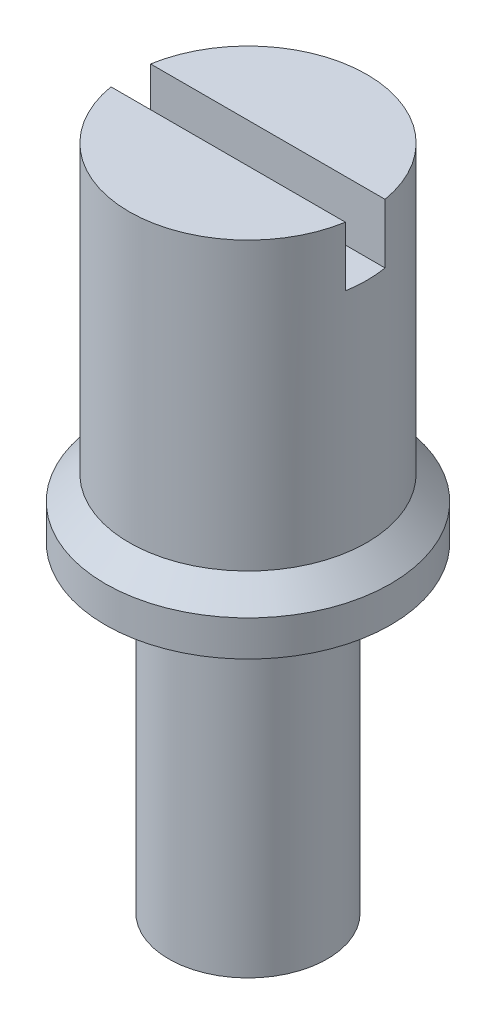
ISO-10303-21;
HEADER;
FILE_DESCRIPTION(('STEP AP214'),'2;1');
FILE_NAME('part.step','',(''),(''),'','','');
FILE_SCHEMA(('AUTOMOTIVE_DESIGN { 1 0 10303 214 1 1 1 1 }'));
ENDSEC;
DATA;
#1=APPLICATION_CONTEXT('core data for automotive mechanical design processes');
#2=APPLICATION_PROTOCOL_DEFINITION('international standard','automotive_design',2000,#1);
#3=PRODUCT_CONTEXT('',#1,'mechanical');
#4=PRODUCT('Part','Part','',(#3));
#5=PRODUCT_RELATED_PRODUCT_CATEGORY('part','',(#4));
#6=PRODUCT_DEFINITION_FORMATION('','',#4);
#7=PRODUCT_DEFINITION_CONTEXT('part definition',#1,'design');
#8=PRODUCT_DEFINITION('design','',#6,#7);
#9=PRODUCT_DEFINITION_SHAPE('','',#8);
#10=(LENGTH_UNIT() NAMED_UNIT(*) SI_UNIT(.MILLI.,.METRE.));
#11=(NAMED_UNIT(*) PLANE_ANGLE_UNIT() SI_UNIT($,.RADIAN.));
#12=(NAMED_UNIT(*) SI_UNIT($,.STERADIAN.) SOLID_ANGLE_UNIT());
#13=UNCERTAINTY_MEASURE_WITH_UNIT(LENGTH_MEASURE(1.E-05),#10,'distance_accuracy_value','');
#14=(GEOMETRIC_REPRESENTATION_CONTEXT(3) GLOBAL_UNCERTAINTY_ASSIGNED_CONTEXT((#13)) GLOBAL_UNIT_ASSIGNED_CONTEXT((#10,
#11,#12)) REPRESENTATION_CONTEXT('',''));
#15=CARTESIAN_POINT('',(0.,0.,0.));
#16=DIRECTION('',(0.,0.,1.));
#17=DIRECTION('',(1.,0.,0.));
#18=AXIS2_PLACEMENT_3D('',#15,#16,#17);
#19=CARTESIAN_POINT('',(0.,43.3233707150231,0.));
#20=DIRECTION('',(0.,1.,0.));
#21=DIRECTION('',(-1.,0.,0.));
#22=AXIS2_PLACEMENT_3D('',#19,#20,#21);
#23=CYLINDRICAL_SURFACE('',#22,3.);
#24=CARTESIAN_POINT('',(0.,1.5,0.));
#25=DIRECTION('',(0.,1.,0.));
#26=DIRECTION('',(-1.,0.,0.));
#27=AXIS2_PLACEMENT_3D('',#24,#25,#26);
#28=CIRCLE('',#27,3.);
#29=CARTESIAN_POINT('',(-3.,1.5,0.));
#30=VERTEX_POINT('',#29);
#31=EDGE_CURVE('E89',#30,#30,#28,.T.);
#32=ORIENTED_EDGE('',*,*,#31,.T.);
#33=EDGE_LOOP('',(#32));
#34=FACE_BOUND('',#33,.T.);
#35=DIRECTION('',(0.,1.,0.));
#36=VECTOR('',#35,1.);
#37=CARTESIAN_POINT('',(-2.95803989154982,43.3233707150231,-0.5));
#38=LINE('',#37,#36);
#39=CARTESIAN_POINT('',(-2.95803989154981,8.73125,-0.5));
#40=VERTEX_POINT('',#39);
#41=CARTESIAN_POINT('',(-2.95803989154981,7.23125,-0.5));
#42=VERTEX_POINT('',#41);
#43=EDGE_CURVE('E86',#40,#42,#38,.F.);
#44=ORIENTED_EDGE('',*,*,#43,.F.);
#45=CARTESIAN_POINT('',(0.,8.73125,0.));
#46=DIRECTION('',(0.,1.,0.));
#47=DIRECTION('',(-1.,0.,0.));
#48=AXIS2_PLACEMENT_3D('',#45,#46,#47);
#49=CIRCLE('',#48,3.00000000000001);
#50=CARTESIAN_POINT('',(2.95803989154981,8.73125,-0.5));
#51=VERTEX_POINT('',#50);
#52=EDGE_CURVE('E90',#51,#40,#49,.T.);
#53=ORIENTED_EDGE('',*,*,#52,.F.);
#54=DIRECTION('',(0.,1.,0.));
#55=VECTOR('',#54,1.);
#56=CARTESIAN_POINT('',(2.9580398915498,43.3233707150231,-0.5));
#57=LINE('',#56,#55);
#58=CARTESIAN_POINT('',(2.95803989154981,7.23125,-0.5));
#59=VERTEX_POINT('',#58);
#60=EDGE_CURVE('E96',#59,#51,#57,.T.);
#61=ORIENTED_EDGE('',*,*,#60,.F.);
#62=CARTESIAN_POINT('',(0.,7.23125,0.));
#63=DIRECTION('',(0.,-1.,0.));
#64=DIRECTION('',(1.,0.,0.));
#65=AXIS2_PLACEMENT_3D('',#62,#63,#64);
#66=CIRCLE('',#65,3.);
#67=CARTESIAN_POINT('',(2.95803989154981,7.23125,0.5));
#68=VERTEX_POINT('',#67);
#69=EDGE_CURVE('E36',#59,#68,#66,.T.);
#70=ORIENTED_EDGE('',*,*,#69,.T.);
#71=DIRECTION('',(0.,1.,0.));
#72=VECTOR('',#71,1.);
#73=CARTESIAN_POINT('',(2.9580398915498,43.3233707150231,0.5));
#74=LINE('',#73,#72);
#75=CARTESIAN_POINT('',(2.95803989154981,8.73125,0.5));
#76=VERTEX_POINT('',#75);
#77=EDGE_CURVE('E75',#68,#76,#74,.T.);
#78=ORIENTED_EDGE('',*,*,#77,.T.);
#79=CARTESIAN_POINT('',(-2.95803989154981,8.73125,0.5));
#80=VERTEX_POINT('',#79);
#81=EDGE_CURVE('E84',#80,#76,#49,.T.);
#82=ORIENTED_EDGE('',*,*,#81,.F.);
#83=DIRECTION('',(0.,1.,0.));
#84=VECTOR('',#83,1.);
#85=CARTESIAN_POINT('',(-2.95803989154982,43.3233707150231,0.5));
#86=LINE('',#85,#84);
#87=CARTESIAN_POINT('',(-2.95803989154981,7.23125,0.5));
#88=VERTEX_POINT('',#87);
#89=EDGE_CURVE('E47',#80,#88,#86,.F.);
#90=ORIENTED_EDGE('',*,*,#89,.T.);
#91=EDGE_CURVE('E11',#88,#42,#66,.T.);
#92=ORIENTED_EDGE('',*,*,#91,.T.);
#93=EDGE_LOOP('',(#44,#53,#61,#70,#78,#82,#90,#92));
#94=FACE_BOUND('',#93,.T.);
#95=ADVANCED_FACE('F32',(#34,#94),#23,.T.);
#96=CARTESIAN_POINT('',(3.00000000000001,8.73125,0.));
#97=DIRECTION('',(0.,-1.,0.));
#98=DIRECTION('',(1.,0.,0.));
#99=AXIS2_PLACEMENT_3D('',#96,#97,#98);
#100=PLANE('',#99);
#101=DIRECTION('',(-1.,0.,0.));
#102=VECTOR('',#101,1.);
#103=CARTESIAN_POINT('',(3.00000000000001,8.73125,-0.5));
#104=LINE('',#103,#102);
#105=EDGE_CURVE('E79',#51,#40,#104,.T.);
#106=ORIENTED_EDGE('',*,*,#105,.F.);
#107=ORIENTED_EDGE('',*,*,#52,.T.);
#108=EDGE_LOOP('',(#106,#107));
#109=FACE_BOUND('',#108,.T.);
#110=ADVANCED_FACE('F114',(#109),#100,.F.);
#111=CARTESIAN_POINT('',(0.,-8.1,0.));
#112=DIRECTION('',(0.,1.,0.));
#113=DIRECTION('',(-1.,0.,0.));
#114=AXIS2_PLACEMENT_3D('',#111,#112,#113);
#115=PLANE('',#114);
#116=CARTESIAN_POINT('',(0.,-8.1,0.));
#117=DIRECTION('',(0.,1.,0.));
#118=DIRECTION('',(-1.,0.,0.));
#119=AXIS2_PLACEMENT_3D('',#116,#117,#118);
#120=CIRCLE('',#119,2.);
#121=CARTESIAN_POINT('',(-2.,-8.1,0.));
#122=VERTEX_POINT('',#121);
#123=EDGE_CURVE('E80',#122,#122,#120,.T.);
#124=ORIENTED_EDGE('',*,*,#123,.F.);
#125=EDGE_LOOP('',(#124));
#126=FACE_BOUND('',#125,.T.);
#127=ADVANCED_FACE('F34',(#126),#115,.F.);
#128=CARTESIAN_POINT('',(0.,43.3233707150231,0.));
#129=DIRECTION('',(0.,1.,0.));
#130=DIRECTION('',(-1.,0.,0.));
#131=AXIS2_PLACEMENT_3D('',#128,#129,#130);
#132=CYLINDRICAL_SURFACE('',#131,2.);
#133=CARTESIAN_POINT('',(0.,0.,0.));
#134=DIRECTION('',(0.,1.,0.));
#135=DIRECTION('',(-1.,0.,0.));
#136=AXIS2_PLACEMENT_3D('',#133,#134,#135);
#137=CIRCLE('',#136,2.00000000000001);
#138=CARTESIAN_POINT('',(-2.,0.,0.));
#139=VERTEX_POINT('',#138);
#140=EDGE_CURVE('E105',#139,#139,#137,.T.);
#141=ORIENTED_EDGE('',*,*,#140,.F.);
#142=EDGE_LOOP('',(#141));
#143=FACE_BOUND('',#142,.T.);
#144=ORIENTED_EDGE('',*,*,#123,.T.);
#145=EDGE_LOOP('',(#144));
#146=FACE_BOUND('',#145,.T.);
#147=ADVANCED_FACE('F121',(#143,#146),#132,.T.);
#148=CARTESIAN_POINT('',(2.00000000000001,0.,0.));
#149=DIRECTION('',(0.,1.,0.));
#150=DIRECTION('',(-1.,0.,0.));
#151=AXIS2_PLACEMENT_3D('',#148,#149,#150);
#152=PLANE('',#151);
#153=CARTESIAN_POINT('',(0.,0.,0.));
#154=DIRECTION('',(0.,1.,0.));
#155=DIRECTION('',(-1.,0.,0.));
#156=AXIS2_PLACEMENT_3D('',#153,#154,#155);
#157=CIRCLE('',#156,3.6);
#158=CARTESIAN_POINT('',(-3.6,0.,0.));
#159=VERTEX_POINT('',#158);
#160=EDGE_CURVE('E102',#159,#159,#157,.T.);
#161=ORIENTED_EDGE('',*,*,#160,.F.);
#162=EDGE_LOOP('',(#161));
#163=FACE_BOUND('',#162,.T.);
#164=ORIENTED_EDGE('',*,*,#140,.T.);
#165=EDGE_LOOP('',(#164));
#166=FACE_BOUND('',#165,.T.);
#167=ADVANCED_FACE('F140',(#163,#166),#152,.F.);
#168=CARTESIAN_POINT('',(0.,43.3233707150231,0.));
#169=DIRECTION('',(0.,1.,0.));
#170=DIRECTION('',(-1.,0.,0.));
#171=AXIS2_PLACEMENT_3D('',#168,#169,#170);
#172=CYLINDRICAL_SURFACE('',#171,3.6);
#173=CARTESIAN_POINT('',(0.,0.899999999999998,0.));
#174=DIRECTION('',(0.,1.,0.));
#175=DIRECTION('',(-1.,0.,0.));
#176=AXIS2_PLACEMENT_3D('',#173,#174,#175);
#177=CIRCLE('',#176,3.6);
#178=CARTESIAN_POINT('',(-3.6,0.899999999999997,0.));
#179=VERTEX_POINT('',#178);
#180=EDGE_CURVE('E93',#179,#179,#177,.T.);
#181=ORIENTED_EDGE('',*,*,#180,.F.);
#182=EDGE_LOOP('',(#181));
#183=FACE_BOUND('',#182,.T.);
#184=ORIENTED_EDGE('',*,*,#160,.T.);
#185=EDGE_LOOP('',(#184));
#186=FACE_BOUND('',#185,.T.);
#187=ADVANCED_FACE('F134',(#183,#186),#172,.T.);
#188=CARTESIAN_POINT('',(0.,0.899999999999998,0.));
#189=DIRECTION('',(0.,-1.,0.));
#190=DIRECTION('',(1.,0.,0.));
#191=AXIS2_PLACEMENT_3D('',#188,#189,#190);
#192=CONICAL_SURFACE('',#191,3.6,0.785398163397445);
#193=ORIENTED_EDGE('',*,*,#31,.F.);
#194=EDGE_LOOP('',(#193));
#195=FACE_BOUND('',#194,.T.);
#196=ORIENTED_EDGE('',*,*,#180,.T.);
#197=EDGE_LOOP('',(#196));
#198=FACE_BOUND('',#197,.T.);
#199=ADVANCED_FACE('F128',(#195,#198),#192,.T.);
#200=ORIENTED_EDGE('',*,*,#81,.T.);
#201=DIRECTION('',(-1.,0.,0.));
#202=VECTOR('',#201,1.);
#203=CARTESIAN_POINT('',(3.00000000000001,8.73125,0.5));
#204=LINE('',#203,#202);
#205=EDGE_CURVE('E72',#76,#80,#204,.T.);
#206=ORIENTED_EDGE('',*,*,#205,.T.);
#207=EDGE_LOOP('',(#200,#206));
#208=FACE_BOUND('',#207,.T.);
#209=ADVANCED_FACE('F88',(#208),#100,.F.);
#210=CARTESIAN_POINT('',(0.,7.23125,0.));
#211=DIRECTION('',(0.,-1.,0.));
#212=DIRECTION('',(1.,0.,0.));
#213=AXIS2_PLACEMENT_3D('',#210,#211,#212);
#214=PLANE('',#213);
#215=DIRECTION('',(1.,0.,0.));
#216=VECTOR('',#215,1.);
#217=CARTESIAN_POINT('',(-3.00000000000001,7.23125,0.5));
#218=LINE('',#217,#216);
#219=EDGE_CURVE('E220',#88,#68,#218,.T.);
#220=ORIENTED_EDGE('',*,*,#219,.T.);
#221=ORIENTED_EDGE('',*,*,#69,.F.);
#222=DIRECTION('',(1.,0.,0.));
#223=VECTOR('',#222,1.);
#224=CARTESIAN_POINT('',(-3.00000000000001,7.23125,-0.5));
#225=LINE('',#224,#223);
#226=EDGE_CURVE('E221',#42,#59,#225,.T.);
#227=ORIENTED_EDGE('',*,*,#226,.F.);
#228=ORIENTED_EDGE('',*,*,#91,.F.);
#229=EDGE_LOOP('',(#220,#221,#227,#228));
#230=FACE_BOUND('',#229,.T.);
#231=ADVANCED_FACE('F127',(#230),#214,.F.);
#232=CARTESIAN_POINT('',(-3.00000000000001,7.23125,-0.5));
#233=DIRECTION('',(0.,0.,1.));
#234=DIRECTION('',(1.,0.,0.));
#235=AXIS2_PLACEMENT_3D('',#232,#233,#234);
#236=PLANE('',#235);
#237=ORIENTED_EDGE('',*,*,#60,.T.);
#238=ORIENTED_EDGE('',*,*,#105,.T.);
#239=ORIENTED_EDGE('',*,*,#43,.T.);
#240=ORIENTED_EDGE('',*,*,#226,.T.);
#241=EDGE_LOOP('',(#237,#238,#239,#240));
#242=FACE_BOUND('',#241,.T.);
#243=ADVANCED_FACE('F111',(#242),#236,.T.);
#244=CARTESIAN_POINT('',(-3.00000000000001,7.23125,0.5));
#245=DIRECTION('',(0.,0.,1.));
#246=DIRECTION('',(1.,0.,0.));
#247=AXIS2_PLACEMENT_3D('',#244,#245,#246);
#248=PLANE('',#247);
#249=ORIENTED_EDGE('',*,*,#219,.F.);
#250=ORIENTED_EDGE('',*,*,#89,.F.);
#251=ORIENTED_EDGE('',*,*,#205,.F.);
#252=ORIENTED_EDGE('',*,*,#77,.F.);
#253=EDGE_LOOP('',(#249,#250,#251,#252));
#254=FACE_BOUND('',#253,.T.);
#255=ADVANCED_FACE('F74',(#254),#248,.F.);
#256=CLOSED_SHELL('',(#95,#110,#127,#147,#167,#187,#199,#209,#231,#243,#255));
#257=MANIFOLD_SOLID_BREP('B2',#256);
#258=ADVANCED_BREP_SHAPE_REPRESENTATION('',(#18,#257),#14);
#259=SHAPE_DEFINITION_REPRESENTATION(#9,#258);
ENDSEC;
END-ISO-10303-21;
